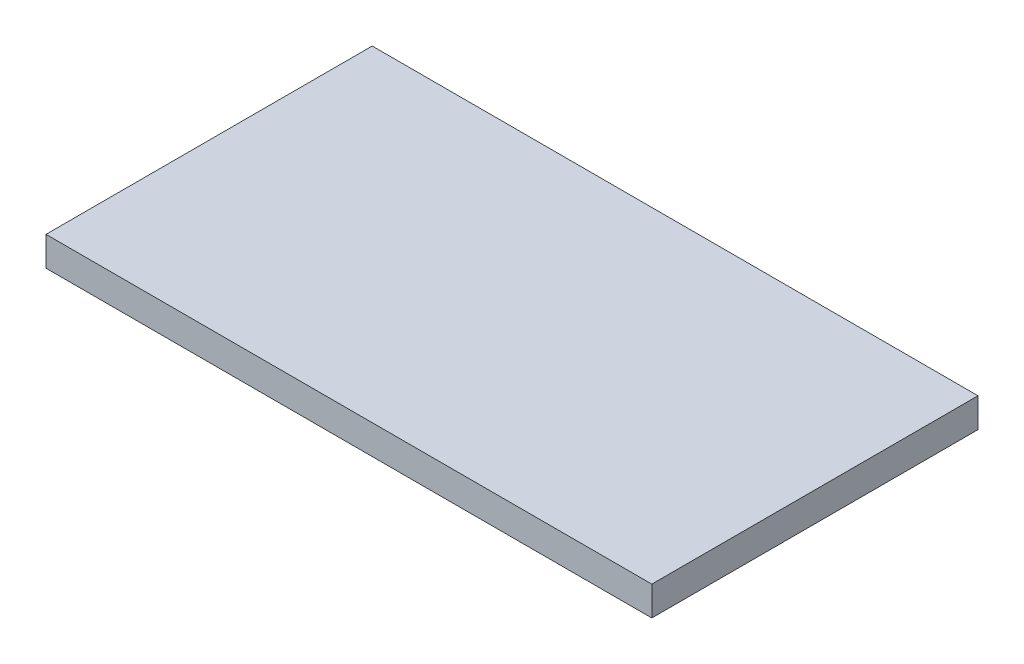
ISO-10303-21;
HEADER;
FILE_DESCRIPTION(('STEP AP214'),'2;1');
FILE_NAME('part.step','',(''),(''),'','','');
FILE_SCHEMA(('AUTOMOTIVE_DESIGN { 1 0 10303 214 1 1 1 1 }'));
ENDSEC;
DATA;
#1=APPLICATION_CONTEXT('core data for automotive mechanical design processes');
#2=APPLICATION_PROTOCOL_DEFINITION('international standard','automotive_design',2000,#1);
#3=PRODUCT_CONTEXT('',#1,'mechanical');
#4=PRODUCT('Part','Part','',(#3));
#5=PRODUCT_RELATED_PRODUCT_CATEGORY('part','',(#4));
#6=PRODUCT_DEFINITION_FORMATION('','',#4);
#7=PRODUCT_DEFINITION_CONTEXT('part definition',#1,'design');
#8=PRODUCT_DEFINITION('design','',#6,#7);
#9=PRODUCT_DEFINITION_SHAPE('','',#8);
#10=(LENGTH_UNIT() NAMED_UNIT(*) SI_UNIT(.MILLI.,.METRE.));
#11=(NAMED_UNIT(*) PLANE_ANGLE_UNIT() SI_UNIT($,.RADIAN.));
#12=(NAMED_UNIT(*) SI_UNIT($,.STERADIAN.) SOLID_ANGLE_UNIT());
#13=UNCERTAINTY_MEASURE_WITH_UNIT(LENGTH_MEASURE(1.E-05),#10,'distance_accuracy_value','');
#14=(GEOMETRIC_REPRESENTATION_CONTEXT(3) GLOBAL_UNCERTAINTY_ASSIGNED_CONTEXT((#13)) GLOBAL_UNIT_ASSIGNED_CONTEXT((#10,
#11,#12)) REPRESENTATION_CONTEXT('',''));
#15=CARTESIAN_POINT('',(0.,0.,0.));
#16=DIRECTION('',(0.,0.,1.));
#17=DIRECTION('',(1.,0.,0.));
#18=AXIS2_PLACEMENT_3D('',#15,#16,#17);
#19=CARTESIAN_POINT('',(-3.81,1.6,-16.51));
#20=DIRECTION('',(1.,0.,0.));
#21=DIRECTION('',(0.,0.,-1.));
#22=AXIS2_PLACEMENT_3D('',#19,#20,#21);
#23=PLANE('',#22);
#24=DIRECTION('',(0.,0.,1.));
#25=VECTOR('',#24,1.);
#26=CARTESIAN_POINT('',(-3.81,0.,-16.51));
#27=LINE('',#26,#25);
#28=CARTESIAN_POINT('',(-3.81,0.,-16.51));
#29=VERTEX_POINT('',#28);
#30=CARTESIAN_POINT('',(-3.81,0.,1.27));
#31=VERTEX_POINT('',#30);
#32=EDGE_CURVE('E116',#29,#31,#27,.T.);
#33=ORIENTED_EDGE('',*,*,#32,.T.);
#34=DIRECTION('',(0.,-1.,0.));
#35=VECTOR('',#34,1.);
#36=CARTESIAN_POINT('',(-3.81,1.6,1.27));
#37=LINE('',#36,#35);
#38=CARTESIAN_POINT('',(-3.81,1.6,1.27));
#39=VERTEX_POINT('',#38);
#40=EDGE_CURVE('E11',#39,#31,#37,.T.);
#41=ORIENTED_EDGE('',*,*,#40,.F.);
#42=DIRECTION('',(0.,0.,1.));
#43=VECTOR('',#42,1.);
#44=CARTESIAN_POINT('',(-3.81,1.6,-16.51));
#45=LINE('',#44,#43);
#46=CARTESIAN_POINT('',(-3.81,1.6,-16.51));
#47=VERTEX_POINT('',#46);
#48=EDGE_CURVE('E100',#47,#39,#45,.T.);
#49=ORIENTED_EDGE('',*,*,#48,.F.);
#50=DIRECTION('',(0.,-1.,0.));
#51=VECTOR('',#50,1.);
#52=CARTESIAN_POINT('',(-3.81,1.6,-16.51));
#53=LINE('',#52,#51);
#54=EDGE_CURVE('E112',#47,#29,#53,.T.);
#55=ORIENTED_EDGE('',*,*,#54,.T.);
#56=EDGE_LOOP('',(#33,#41,#49,#55));
#57=FACE_BOUND('',#56,.T.);
#58=ADVANCED_FACE('F41',(#57),#23,.F.);
#59=CARTESIAN_POINT('',(-3.81,1.6,1.27));
#60=DIRECTION('',(0.,0.,-1.));
#61=DIRECTION('',(-1.,0.,0.));
#62=AXIS2_PLACEMENT_3D('',#59,#60,#61);
#63=PLANE('',#62);
#64=DIRECTION('',(1.,0.,0.));
#65=VECTOR('',#64,1.);
#66=CARTESIAN_POINT('',(-3.81,0.,1.27));
#67=LINE('',#66,#65);
#68=CARTESIAN_POINT('',(29.21,0.,1.27));
#69=VERTEX_POINT('',#68);
#70=EDGE_CURVE('E105',#31,#69,#67,.T.);
#71=ORIENTED_EDGE('',*,*,#70,.T.);
#72=DIRECTION('',(0.,-1.,0.));
#73=VECTOR('',#72,1.);
#74=CARTESIAN_POINT('',(29.21,1.6,1.27));
#75=LINE('',#74,#73);
#76=CARTESIAN_POINT('',(29.21,1.6,1.27));
#77=VERTEX_POINT('',#76);
#78=EDGE_CURVE('E50',#77,#69,#75,.T.);
#79=ORIENTED_EDGE('',*,*,#78,.F.);
#80=DIRECTION('',(1.,0.,0.));
#81=VECTOR('',#80,1.);
#82=CARTESIAN_POINT('',(-3.81,1.6,1.27));
#83=LINE('',#82,#81);
#84=EDGE_CURVE('E95',#39,#77,#83,.T.);
#85=ORIENTED_EDGE('',*,*,#84,.F.);
#86=ORIENTED_EDGE('',*,*,#40,.T.);
#87=EDGE_LOOP('',(#71,#79,#85,#86));
#88=FACE_BOUND('',#87,.T.);
#89=ADVANCED_FACE('F104',(#88),#63,.F.);
#90=CARTESIAN_POINT('',(29.21,1.6,-16.51));
#91=DIRECTION('',(-1.,0.,0.));
#92=DIRECTION('',(0.,0.,1.));
#93=AXIS2_PLACEMENT_3D('',#90,#91,#92);
#94=PLANE('',#93);
#95=DIRECTION('',(0.,0.,-1.));
#96=VECTOR('',#95,1.);
#97=CARTESIAN_POINT('',(29.21,0.,-16.51));
#98=LINE('',#97,#96);
#99=CARTESIAN_POINT('',(29.21,0.,-16.51));
#100=VERTEX_POINT('',#99);
#101=EDGE_CURVE('E80',#69,#100,#98,.T.);
#102=ORIENTED_EDGE('',*,*,#101,.T.);
#103=DIRECTION('',(0.,-1.,0.));
#104=VECTOR('',#103,1.);
#105=CARTESIAN_POINT('',(29.21,1.6,-16.51));
#106=LINE('',#105,#104);
#107=CARTESIAN_POINT('',(29.21,1.6,-16.51));
#108=VERTEX_POINT('',#107);
#109=EDGE_CURVE('E107',#108,#100,#106,.T.);
#110=ORIENTED_EDGE('',*,*,#109,.F.);
#111=DIRECTION('',(0.,0.,-1.));
#112=VECTOR('',#111,1.);
#113=CARTESIAN_POINT('',(29.21,1.6,-16.51));
#114=LINE('',#113,#112);
#115=EDGE_CURVE('E98',#77,#108,#114,.T.);
#116=ORIENTED_EDGE('',*,*,#115,.F.);
#117=ORIENTED_EDGE('',*,*,#78,.T.);
#118=EDGE_LOOP('',(#102,#110,#116,#117));
#119=FACE_BOUND('',#118,.T.);
#120=ADVANCED_FACE('F108',(#119),#94,.F.);
#121=CARTESIAN_POINT('',(-3.81,1.6,-16.51));
#122=DIRECTION('',(0.,0.,1.));
#123=DIRECTION('',(1.,0.,0.));
#124=AXIS2_PLACEMENT_3D('',#121,#122,#123);
#125=PLANE('',#124);
#126=DIRECTION('',(-1.,0.,0.));
#127=VECTOR('',#126,1.);
#128=CARTESIAN_POINT('',(-3.81,0.,-16.51));
#129=LINE('',#128,#127);
#130=EDGE_CURVE('E87',#100,#29,#129,.T.);
#131=ORIENTED_EDGE('',*,*,#130,.T.);
#132=ORIENTED_EDGE('',*,*,#54,.F.);
#133=DIRECTION('',(-1.,0.,0.));
#134=VECTOR('',#133,1.);
#135=CARTESIAN_POINT('',(-3.81,1.6,-16.51));
#136=LINE('',#135,#134);
#137=EDGE_CURVE('E61',#108,#47,#136,.T.);
#138=ORIENTED_EDGE('',*,*,#137,.F.);
#139=ORIENTED_EDGE('',*,*,#109,.T.);
#140=EDGE_LOOP('',(#131,#132,#138,#139));
#141=FACE_BOUND('',#140,.T.);
#142=ADVANCED_FACE('F128',(#141),#125,.F.);
#143=CARTESIAN_POINT('',(0.,1.6,0.));
#144=DIRECTION('',(0.,1.,0.));
#145=DIRECTION('',(0.,0.,1.));
#146=AXIS2_PLACEMENT_3D('',#143,#144,#145);
#147=PLANE('',#146);
#148=ORIENTED_EDGE('',*,*,#48,.T.);
#149=ORIENTED_EDGE('',*,*,#84,.T.);
#150=ORIENTED_EDGE('',*,*,#115,.T.);
#151=ORIENTED_EDGE('',*,*,#137,.T.);
#152=EDGE_LOOP('',(#148,#149,#150,#151));
#153=FACE_BOUND('',#152,.T.);
#154=ADVANCED_FACE('F96',(#153),#147,.T.);
#155=CARTESIAN_POINT('',(0.,0.,0.));
#156=DIRECTION('',(0.,1.,0.));
#157=DIRECTION('',(0.,0.,1.));
#158=AXIS2_PLACEMENT_3D('',#155,#156,#157);
#159=PLANE('',#158);
#160=ORIENTED_EDGE('',*,*,#32,.F.);
#161=ORIENTED_EDGE('',*,*,#130,.F.);
#162=ORIENTED_EDGE('',*,*,#101,.F.);
#163=ORIENTED_EDGE('',*,*,#70,.F.);
#164=EDGE_LOOP('',(#160,#161,#162,#163));
#165=FACE_BOUND('',#164,.T.);
#166=ADVANCED_FACE('F131',(#165),#159,.F.);
#167=CLOSED_SHELL('',(#58,#89,#120,#142,#154,#166));
#168=MANIFOLD_SOLID_BREP('B2',#167);
#169=ADVANCED_BREP_SHAPE_REPRESENTATION('',(#18,#168),#14);
#170=SHAPE_DEFINITION_REPRESENTATION(#9,#169);
ENDSEC;
END-ISO-10303-21;
